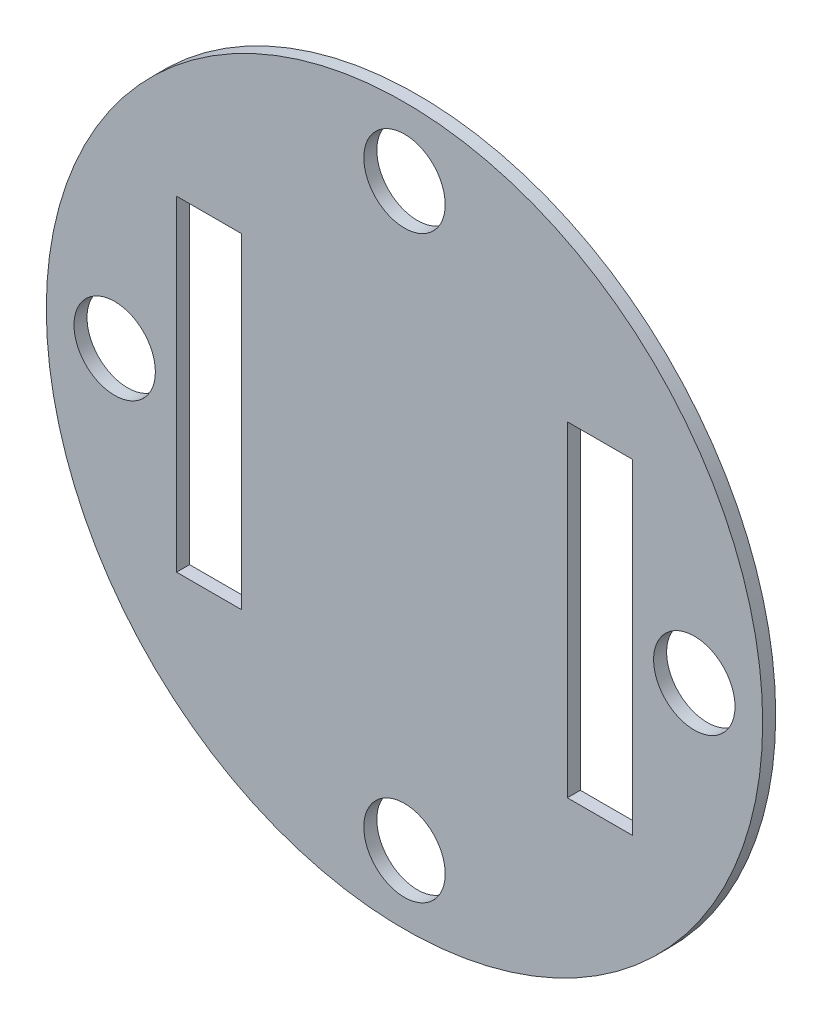
ISO-10303-21;
HEADER;
FILE_DESCRIPTION(('STEP AP214'),'2;1');
FILE_NAME('part.step','',(''),(''),'','','');
FILE_SCHEMA(('AUTOMOTIVE_DESIGN { 1 0 10303 214 1 1 1 1 }'));
ENDSEC;
DATA;
#1=APPLICATION_CONTEXT('core data for automotive mechanical design processes');
#2=APPLICATION_PROTOCOL_DEFINITION('international standard','automotive_design',2000,#1);
#3=PRODUCT_CONTEXT('',#1,'mechanical');
#4=PRODUCT('Part','Part','',(#3));
#5=PRODUCT_RELATED_PRODUCT_CATEGORY('part','',(#4));
#6=PRODUCT_DEFINITION_FORMATION('','',#4);
#7=PRODUCT_DEFINITION_CONTEXT('part definition',#1,'design');
#8=PRODUCT_DEFINITION('design','',#6,#7);
#9=PRODUCT_DEFINITION_SHAPE('','',#8);
#10=(LENGTH_UNIT() NAMED_UNIT(*) SI_UNIT(.MILLI.,.METRE.));
#11=(NAMED_UNIT(*) PLANE_ANGLE_UNIT() SI_UNIT($,.RADIAN.));
#12=(NAMED_UNIT(*) SI_UNIT($,.STERADIAN.) SOLID_ANGLE_UNIT());
#13=UNCERTAINTY_MEASURE_WITH_UNIT(LENGTH_MEASURE(1.E-05),#10,'distance_accuracy_value','');
#14=(GEOMETRIC_REPRESENTATION_CONTEXT(3) GLOBAL_UNCERTAINTY_ASSIGNED_CONTEXT((#13)) GLOBAL_UNIT_ASSIGNED_CONTEXT((#10,
#11,#12)) REPRESENTATION_CONTEXT('',''));
#15=CARTESIAN_POINT('',(0.,0.,0.));
#16=DIRECTION('',(0.,0.,1.));
#17=DIRECTION('',(1.,0.,0.));
#18=AXIS2_PLACEMENT_3D('',#15,#16,#17);
#19=CARTESIAN_POINT('',(0.,0.,0.));
#20=DIRECTION('',(0.,0.,1.));
#21=DIRECTION('',(1.,0.,0.));
#22=AXIS2_PLACEMENT_3D('',#19,#20,#21);
#23=PLANE('',#22);
#24=DIRECTION('',(-1.,0.,0.));
#25=VECTOR('',#24,1.);
#26=CARTESIAN_POINT('',(0.,25.,0.));
#27=LINE('',#26,#25);
#28=CARTESIAN_POINT('',(35.,25.,0.));
#29=VERTEX_POINT('',#28);
#30=CARTESIAN_POINT('',(25.,25.,0.));
#31=VERTEX_POINT('',#30);
#32=EDGE_CURVE('E241',#29,#31,#27,.T.);
#33=ORIENTED_EDGE('',*,*,#32,.T.);
#34=DIRECTION('',(0.,-1.,0.));
#35=VECTOR('',#34,1.);
#36=CARTESIAN_POINT('',(25.,0.,0.));
#37=LINE('',#36,#35);
#38=CARTESIAN_POINT('',(25.,-25.,0.));
#39=VERTEX_POINT('',#38);
#40=EDGE_CURVE('E245',#31,#39,#37,.T.);
#41=ORIENTED_EDGE('',*,*,#40,.T.);
#42=DIRECTION('',(1.,0.,0.));
#43=VECTOR('',#42,1.);
#44=CARTESIAN_POINT('',(0.,-25.,0.));
#45=LINE('',#44,#43);
#46=CARTESIAN_POINT('',(35.,-25.,0.));
#47=VERTEX_POINT('',#46);
#48=EDGE_CURVE('E236',#39,#47,#45,.T.);
#49=ORIENTED_EDGE('',*,*,#48,.T.);
#50=DIRECTION('',(0.,1.,0.));
#51=VECTOR('',#50,1.);
#52=CARTESIAN_POINT('',(35.,0.,0.));
#53=LINE('',#52,#51);
#54=EDGE_CURVE('E171',#47,#29,#53,.T.);
#55=ORIENTED_EDGE('',*,*,#54,.T.);
#56=EDGE_LOOP('',(#33,#41,#49,#55));
#57=FACE_BOUND('',#56,.T.);
#58=DIRECTION('',(-1.,0.,0.));
#59=VECTOR('',#58,1.);
#60=CARTESIAN_POINT('',(0.,25.,0.));
#61=LINE('',#60,#59);
#62=CARTESIAN_POINT('',(-25.,25.,0.));
#63=VERTEX_POINT('',#62);
#64=CARTESIAN_POINT('',(-35.,25.,0.));
#65=VERTEX_POINT('',#64);
#66=EDGE_CURVE('E228',#63,#65,#61,.T.);
#67=ORIENTED_EDGE('',*,*,#66,.T.);
#68=DIRECTION('',(0.,-1.,0.));
#69=VECTOR('',#68,1.);
#70=CARTESIAN_POINT('',(-35.,0.,0.));
#71=LINE('',#70,#69);
#72=CARTESIAN_POINT('',(-35.,-25.,0.));
#73=VERTEX_POINT('',#72);
#74=EDGE_CURVE('E232',#65,#73,#71,.T.);
#75=ORIENTED_EDGE('',*,*,#74,.T.);
#76=DIRECTION('',(1.,0.,0.));
#77=VECTOR('',#76,1.);
#78=CARTESIAN_POINT('',(0.,-25.,0.));
#79=LINE('',#78,#77);
#80=CARTESIAN_POINT('',(-25.,-25.,0.));
#81=VERTEX_POINT('',#80);
#82=EDGE_CURVE('E190',#73,#81,#79,.T.);
#83=ORIENTED_EDGE('',*,*,#82,.T.);
#84=DIRECTION('',(0.,1.,0.));
#85=VECTOR('',#84,1.);
#86=CARTESIAN_POINT('',(-25.,0.,0.));
#87=LINE('',#86,#85);
#88=EDGE_CURVE('E224',#81,#63,#87,.T.);
#89=ORIENTED_EDGE('',*,*,#88,.T.);
#90=EDGE_LOOP('',(#67,#75,#83,#89));
#91=FACE_BOUND('',#90,.T.);
#92=CARTESIAN_POINT('',(44.5,0.,0.));
#93=DIRECTION('',(0.,0.,1.));
#94=DIRECTION('',(1.,0.,0.));
#95=AXIS2_PLACEMENT_3D('',#92,#93,#94);
#96=CIRCLE('',#95,6.25);
#97=CARTESIAN_POINT('',(50.75,0.,0.));
#98=VERTEX_POINT('',#97);
#99=EDGE_CURVE('E250',#98,#98,#96,.T.);
#100=ORIENTED_EDGE('',*,*,#99,.T.);
#101=EDGE_LOOP('',(#100));
#102=FACE_BOUND('',#101,.T.);
#103=CARTESIAN_POINT('',(0.,44.5,0.));
#104=DIRECTION('',(0.,0.,1.));
#105=DIRECTION('',(1.,0.,0.));
#106=AXIS2_PLACEMENT_3D('',#103,#104,#105);
#107=CIRCLE('',#106,6.25);
#108=CARTESIAN_POINT('',(6.25,44.5,0.));
#109=VERTEX_POINT('',#108);
#110=EDGE_CURVE('E262',#109,#109,#107,.T.);
#111=ORIENTED_EDGE('',*,*,#110,.T.);
#112=EDGE_LOOP('',(#111));
#113=FACE_BOUND('',#112,.T.);
#114=CARTESIAN_POINT('',(-44.5,0.,0.));
#115=DIRECTION('',(0.,0.,1.));
#116=DIRECTION('',(1.,0.,0.));
#117=AXIS2_PLACEMENT_3D('',#114,#115,#116);
#118=CIRCLE('',#117,6.25);
#119=CARTESIAN_POINT('',(-38.25,0.,0.));
#120=VERTEX_POINT('',#119);
#121=EDGE_CURVE('E270',#120,#120,#118,.T.);
#122=ORIENTED_EDGE('',*,*,#121,.T.);
#123=EDGE_LOOP('',(#122));
#124=FACE_BOUND('',#123,.T.);
#125=CARTESIAN_POINT('',(0.,-44.5,0.));
#126=DIRECTION('',(0.,0.,1.));
#127=DIRECTION('',(1.,0.,0.));
#128=AXIS2_PLACEMENT_3D('',#125,#126,#127);
#129=CIRCLE('',#128,6.25);
#130=CARTESIAN_POINT('',(6.25,-44.5,0.));
#131=VERTEX_POINT('',#130);
#132=EDGE_CURVE('E249',#131,#131,#129,.T.);
#133=ORIENTED_EDGE('',*,*,#132,.T.);
#134=EDGE_LOOP('',(#133));
#135=FACE_BOUND('',#134,.T.);
#136=CARTESIAN_POINT('',(0.,0.,0.));
#137=DIRECTION('',(0.,0.,1.));
#138=DIRECTION('',(1.,0.,0.));
#139=AXIS2_PLACEMENT_3D('',#136,#137,#138);
#140=CIRCLE('',#139,55.);
#141=CARTESIAN_POINT('',(55.,0.,0.));
#142=VERTEX_POINT('',#141);
#143=EDGE_CURVE('E12',#142,#142,#140,.F.);
#144=ORIENTED_EDGE('',*,*,#143,.T.);
#145=EDGE_LOOP('',(#144));
#146=FACE_BOUND('',#145,.T.);
#147=ADVANCED_FACE('F91',(#57,#91,#102,#113,#124,#135,#146),#23,.F.);
#148=CARTESIAN_POINT('',(0.,0.,2.));
#149=DIRECTION('',(0.,0.,1.));
#150=DIRECTION('',(1.,0.,0.));
#151=AXIS2_PLACEMENT_3D('',#148,#149,#150);
#152=PLANE('',#151);
#153=DIRECTION('',(-1.,0.,0.));
#154=VECTOR('',#153,1.);
#155=CARTESIAN_POINT('',(25.,25.,2.));
#156=LINE('',#155,#154);
#157=CARTESIAN_POINT('',(35.,25.,2.));
#158=VERTEX_POINT('',#157);
#159=CARTESIAN_POINT('',(25.,25.,2.));
#160=VERTEX_POINT('',#159);
#161=EDGE_CURVE('E179',#158,#160,#156,.T.);
#162=ORIENTED_EDGE('',*,*,#161,.F.);
#163=DIRECTION('',(0.,1.,0.));
#164=VECTOR('',#163,1.);
#165=CARTESIAN_POINT('',(35.,25.,2.));
#166=LINE('',#165,#164);
#167=CARTESIAN_POINT('',(35.,-25.,2.));
#168=VERTEX_POINT('',#167);
#169=EDGE_CURVE('E163',#168,#158,#166,.T.);
#170=ORIENTED_EDGE('',*,*,#169,.F.);
#171=DIRECTION('',(1.,0.,0.));
#172=VECTOR('',#171,1.);
#173=CARTESIAN_POINT('',(25.,-25.,2.));
#174=LINE('',#173,#172);
#175=CARTESIAN_POINT('',(25.,-25.,2.));
#176=VERTEX_POINT('',#175);
#177=EDGE_CURVE('E155',#176,#168,#174,.T.);
#178=ORIENTED_EDGE('',*,*,#177,.F.);
#179=DIRECTION('',(0.,-1.,0.));
#180=VECTOR('',#179,1.);
#181=CARTESIAN_POINT('',(25.,25.,2.));
#182=LINE('',#181,#180);
#183=EDGE_CURVE('E164',#160,#176,#182,.T.);
#184=ORIENTED_EDGE('',*,*,#183,.F.);
#185=EDGE_LOOP('',(#162,#170,#178,#184));
#186=FACE_BOUND('',#185,.T.);
#187=CARTESIAN_POINT('',(0.,-44.5,2.));
#188=DIRECTION('',(0.,0.,1.));
#189=DIRECTION('',(1.,0.,0.));
#190=AXIS2_PLACEMENT_3D('',#187,#188,#189);
#191=CIRCLE('',#190,6.25);
#192=CARTESIAN_POINT('',(6.25,-44.5,2.));
#193=VERTEX_POINT('',#192);
#194=EDGE_CURVE('E274',#193,#193,#191,.T.);
#195=ORIENTED_EDGE('',*,*,#194,.F.);
#196=EDGE_LOOP('',(#195));
#197=FACE_BOUND('',#196,.T.);
#198=DIRECTION('',(0.,1.,0.));
#199=VECTOR('',#198,1.);
#200=CARTESIAN_POINT('',(-25.,25.,2.));
#201=LINE('',#200,#199);
#202=CARTESIAN_POINT('',(-25.,-25.,2.));
#203=VERTEX_POINT('',#202);
#204=CARTESIAN_POINT('',(-25.,25.,2.));
#205=VERTEX_POINT('',#204);
#206=EDGE_CURVE('E201',#203,#205,#201,.T.);
#207=ORIENTED_EDGE('',*,*,#206,.F.);
#208=DIRECTION('',(1.,0.,0.));
#209=VECTOR('',#208,1.);
#210=CARTESIAN_POINT('',(-35.,-25.,2.));
#211=LINE('',#210,#209);
#212=CARTESIAN_POINT('',(-35.,-25.,2.));
#213=VERTEX_POINT('',#212);
#214=EDGE_CURVE('E198',#213,#203,#211,.T.);
#215=ORIENTED_EDGE('',*,*,#214,.F.);
#216=DIRECTION('',(0.,-1.,0.));
#217=VECTOR('',#216,1.);
#218=CARTESIAN_POINT('',(-35.,25.,2.));
#219=LINE('',#218,#217);
#220=CARTESIAN_POINT('',(-35.,25.,2.));
#221=VERTEX_POINT('',#220);
#222=EDGE_CURVE('E195',#221,#213,#219,.T.);
#223=ORIENTED_EDGE('',*,*,#222,.F.);
#224=DIRECTION('',(-1.,0.,0.));
#225=VECTOR('',#224,1.);
#226=CARTESIAN_POINT('',(-35.,25.,2.));
#227=LINE('',#226,#225);
#228=EDGE_CURVE('E205',#205,#221,#227,.T.);
#229=ORIENTED_EDGE('',*,*,#228,.F.);
#230=EDGE_LOOP('',(#207,#215,#223,#229));
#231=FACE_BOUND('',#230,.T.);
#232=CARTESIAN_POINT('',(-44.5,0.,2.));
#233=DIRECTION('',(0.,0.,1.));
#234=DIRECTION('',(1.,0.,0.));
#235=AXIS2_PLACEMENT_3D('',#232,#233,#234);
#236=CIRCLE('',#235,6.25);
#237=CARTESIAN_POINT('',(-38.25,0.,2.));
#238=VERTEX_POINT('',#237);
#239=EDGE_CURVE('E266',#238,#238,#236,.T.);
#240=ORIENTED_EDGE('',*,*,#239,.F.);
#241=EDGE_LOOP('',(#240));
#242=FACE_BOUND('',#241,.T.);
#243=CARTESIAN_POINT('',(0.,44.5,2.));
#244=DIRECTION('',(0.,0.,1.));
#245=DIRECTION('',(1.,0.,0.));
#246=AXIS2_PLACEMENT_3D('',#243,#244,#245);
#247=CIRCLE('',#246,6.25);
#248=CARTESIAN_POINT('',(6.25,44.5,2.));
#249=VERTEX_POINT('',#248);
#250=EDGE_CURVE('E258',#249,#249,#247,.T.);
#251=ORIENTED_EDGE('',*,*,#250,.F.);
#252=EDGE_LOOP('',(#251));
#253=FACE_BOUND('',#252,.T.);
#254=CARTESIAN_POINT('',(44.5,0.,2.));
#255=DIRECTION('',(0.,0.,1.));
#256=DIRECTION('',(1.,0.,0.));
#257=AXIS2_PLACEMENT_3D('',#254,#255,#256);
#258=CIRCLE('',#257,6.25);
#259=CARTESIAN_POINT('',(50.75,0.,2.));
#260=VERTEX_POINT('',#259);
#261=EDGE_CURVE('E254',#260,#260,#258,.T.);
#262=ORIENTED_EDGE('',*,*,#261,.F.);
#263=EDGE_LOOP('',(#262));
#264=FACE_BOUND('',#263,.T.);
#265=CARTESIAN_POINT('',(0.,0.,2.));
#266=DIRECTION('',(0.,0.,-1.));
#267=DIRECTION('',(1.,0.,0.));
#268=AXIS2_PLACEMENT_3D('',#265,#266,#267);
#269=CIRCLE('',#268,55.);
#270=CARTESIAN_POINT('',(55.,0.,2.));
#271=VERTEX_POINT('',#270);
#272=EDGE_CURVE('E99',#271,#271,#269,.T.);
#273=ORIENTED_EDGE('',*,*,#272,.F.);
#274=EDGE_LOOP('',(#273));
#275=FACE_BOUND('',#274,.T.);
#276=ADVANCED_FACE('F177',(#186,#197,#231,#242,#253,#264,#275),#152,.T.);
#277=CARTESIAN_POINT('',(0.,0.,-49.9999999999996));
#278=DIRECTION('',(0.,0.,1.));
#279=DIRECTION('',(1.,0.,0.));
#280=AXIS2_PLACEMENT_3D('',#277,#278,#279);
#281=CYLINDRICAL_SURFACE('',#280,55.);
#282=ORIENTED_EDGE('',*,*,#272,.T.);
#283=EDGE_LOOP('',(#282));
#284=FACE_BOUND('',#283,.T.);
#285=ORIENTED_EDGE('',*,*,#143,.F.);
#286=EDGE_LOOP('',(#285));
#287=FACE_BOUND('',#286,.T.);
#288=ADVANCED_FACE('F284',(#284,#287),#281,.T.);
#289=CARTESIAN_POINT('',(0.,-44.5,0.));
#290=DIRECTION('',(0.,0.,1.));
#291=DIRECTION('',(1.,0.,0.));
#292=AXIS2_PLACEMENT_3D('',#289,#290,#291);
#293=CYLINDRICAL_SURFACE('',#292,6.25);
#294=ORIENTED_EDGE('',*,*,#132,.F.);
#295=EDGE_LOOP('',(#294));
#296=FACE_BOUND('',#295,.T.);
#297=ORIENTED_EDGE('',*,*,#194,.T.);
#298=EDGE_LOOP('',(#297));
#299=FACE_BOUND('',#298,.T.);
#300=ADVANCED_FACE('F292',(#296,#299),#293,.F.);
#301=CARTESIAN_POINT('',(-44.5,0.,0.));
#302=DIRECTION('',(0.,0.,1.));
#303=DIRECTION('',(1.,0.,0.));
#304=AXIS2_PLACEMENT_3D('',#301,#302,#303);
#305=CYLINDRICAL_SURFACE('',#304,6.25);
#306=ORIENTED_EDGE('',*,*,#121,.F.);
#307=EDGE_LOOP('',(#306));
#308=FACE_BOUND('',#307,.T.);
#309=ORIENTED_EDGE('',*,*,#239,.T.);
#310=EDGE_LOOP('',(#309));
#311=FACE_BOUND('',#310,.T.);
#312=ADVANCED_FACE('F298',(#308,#311),#305,.F.);
#313=CARTESIAN_POINT('',(0.,44.5,0.));
#314=DIRECTION('',(0.,0.,1.));
#315=DIRECTION('',(1.,0.,0.));
#316=AXIS2_PLACEMENT_3D('',#313,#314,#315);
#317=CYLINDRICAL_SURFACE('',#316,6.25);
#318=ORIENTED_EDGE('',*,*,#110,.F.);
#319=EDGE_LOOP('',(#318));
#320=FACE_BOUND('',#319,.T.);
#321=ORIENTED_EDGE('',*,*,#250,.T.);
#322=EDGE_LOOP('',(#321));
#323=FACE_BOUND('',#322,.T.);
#324=ADVANCED_FACE('F302',(#320,#323),#317,.F.);
#325=CARTESIAN_POINT('',(44.5,0.,0.));
#326=DIRECTION('',(0.,0.,1.));
#327=DIRECTION('',(1.,0.,0.));
#328=AXIS2_PLACEMENT_3D('',#325,#326,#327);
#329=CYLINDRICAL_SURFACE('',#328,6.25);
#330=ORIENTED_EDGE('',*,*,#99,.F.);
#331=EDGE_LOOP('',(#330));
#332=FACE_BOUND('',#331,.T.);
#333=ORIENTED_EDGE('',*,*,#261,.T.);
#334=EDGE_LOOP('',(#333));
#335=FACE_BOUND('',#334,.T.);
#336=ADVANCED_FACE('F306',(#332,#335),#329,.F.);
#337=CARTESIAN_POINT('',(-35.,25.,-1.));
#338=DIRECTION('',(-1.,0.,0.));
#339=DIRECTION('',(0.,-1.,0.));
#340=AXIS2_PLACEMENT_3D('',#337,#338,#339);
#341=PLANE('',#340);
#342=DIRECTION('',(0.,0.,1.));
#343=VECTOR('',#342,1.);
#344=CARTESIAN_POINT('',(-35.,25.,-1.));
#345=LINE('',#344,#343);
#346=EDGE_CURVE('E209',#65,#221,#345,.T.);
#347=ORIENTED_EDGE('',*,*,#346,.T.);
#348=ORIENTED_EDGE('',*,*,#222,.T.);
#349=DIRECTION('',(0.,0.,1.));
#350=VECTOR('',#349,1.);
#351=CARTESIAN_POINT('',(-35.,-25.,-1.));
#352=LINE('',#351,#350);
#353=EDGE_CURVE('E208',#73,#213,#352,.T.);
#354=ORIENTED_EDGE('',*,*,#353,.F.);
#355=ORIENTED_EDGE('',*,*,#74,.F.);
#356=EDGE_LOOP('',(#347,#348,#354,#355));
#357=FACE_BOUND('',#356,.T.);
#358=ADVANCED_FACE('F310',(#357),#341,.F.);
#359=CARTESIAN_POINT('',(-35.,25.,-1.));
#360=DIRECTION('',(0.,1.,0.));
#361=DIRECTION('',(-1.,0.,0.));
#362=AXIS2_PLACEMENT_3D('',#359,#360,#361);
#363=PLANE('',#362);
#364=DIRECTION('',(0.,0.,1.));
#365=VECTOR('',#364,1.);
#366=CARTESIAN_POINT('',(-25.,25.,-1.));
#367=LINE('',#366,#365);
#368=EDGE_CURVE('E213',#63,#205,#367,.T.);
#369=ORIENTED_EDGE('',*,*,#368,.T.);
#370=ORIENTED_EDGE('',*,*,#228,.T.);
#371=ORIENTED_EDGE('',*,*,#346,.F.);
#372=ORIENTED_EDGE('',*,*,#66,.F.);
#373=EDGE_LOOP('',(#369,#370,#371,#372));
#374=FACE_BOUND('',#373,.T.);
#375=ADVANCED_FACE('F314',(#374),#363,.F.);
#376=CARTESIAN_POINT('',(-25.,25.,-1.));
#377=DIRECTION('',(1.,0.,0.));
#378=DIRECTION('',(0.,1.,0.));
#379=AXIS2_PLACEMENT_3D('',#376,#377,#378);
#380=PLANE('',#379);
#381=DIRECTION('',(0.,0.,1.));
#382=VECTOR('',#381,1.);
#383=CARTESIAN_POINT('',(-25.,-25.,-1.));
#384=LINE('',#383,#382);
#385=EDGE_CURVE('E114',#81,#203,#384,.T.);
#386=ORIENTED_EDGE('',*,*,#385,.T.);
#387=ORIENTED_EDGE('',*,*,#206,.T.);
#388=ORIENTED_EDGE('',*,*,#368,.F.);
#389=ORIENTED_EDGE('',*,*,#88,.F.);
#390=EDGE_LOOP('',(#386,#387,#388,#389));
#391=FACE_BOUND('',#390,.T.);
#392=ADVANCED_FACE('F320',(#391),#380,.F.);
#393=CARTESIAN_POINT('',(-35.,-25.,-1.));
#394=DIRECTION('',(0.,-1.,0.));
#395=DIRECTION('',(0.,0.,-1.));
#396=AXIS2_PLACEMENT_3D('',#393,#394,#395);
#397=PLANE('',#396);
#398=ORIENTED_EDGE('',*,*,#353,.T.);
#399=ORIENTED_EDGE('',*,*,#214,.T.);
#400=ORIENTED_EDGE('',*,*,#385,.F.);
#401=ORIENTED_EDGE('',*,*,#82,.F.);
#402=EDGE_LOOP('',(#398,#399,#400,#401));
#403=FACE_BOUND('',#402,.T.);
#404=ADVANCED_FACE('F316',(#403),#397,.F.);
#405=CARTESIAN_POINT('',(25.,25.,-1.));
#406=DIRECTION('',(-1.,0.,0.));
#407=DIRECTION('',(0.,-1.,0.));
#408=AXIS2_PLACEMENT_3D('',#405,#406,#407);
#409=PLANE('',#408);
#410=DIRECTION('',(0.,0.,1.));
#411=VECTOR('',#410,1.);
#412=CARTESIAN_POINT('',(25.,25.,-1.));
#413=LINE('',#412,#411);
#414=EDGE_CURVE('E186',#31,#160,#413,.T.);
#415=ORIENTED_EDGE('',*,*,#414,.T.);
#416=ORIENTED_EDGE('',*,*,#183,.T.);
#417=DIRECTION('',(0.,0.,1.));
#418=VECTOR('',#417,1.);
#419=CARTESIAN_POINT('',(25.,-25.,-1.));
#420=LINE('',#419,#418);
#421=EDGE_CURVE('E158',#39,#176,#420,.T.);
#422=ORIENTED_EDGE('',*,*,#421,.F.);
#423=ORIENTED_EDGE('',*,*,#40,.F.);
#424=EDGE_LOOP('',(#415,#416,#422,#423));
#425=FACE_BOUND('',#424,.T.);
#426=ADVANCED_FACE('F319',(#425),#409,.F.);
#427=CARTESIAN_POINT('',(25.,25.,-1.));
#428=DIRECTION('',(0.,1.,0.));
#429=DIRECTION('',(-1.,0.,0.));
#430=AXIS2_PLACEMENT_3D('',#427,#428,#429);
#431=PLANE('',#430);
#432=DIRECTION('',(0.,0.,1.));
#433=VECTOR('',#432,1.);
#434=CARTESIAN_POINT('',(35.,25.,-1.));
#435=LINE('',#434,#433);
#436=EDGE_CURVE('E174',#29,#158,#435,.T.);
#437=ORIENTED_EDGE('',*,*,#436,.T.);
#438=ORIENTED_EDGE('',*,*,#161,.T.);
#439=ORIENTED_EDGE('',*,*,#414,.F.);
#440=ORIENTED_EDGE('',*,*,#32,.F.);
#441=EDGE_LOOP('',(#437,#438,#439,#440));
#442=FACE_BOUND('',#441,.T.);
#443=ADVANCED_FACE('F329',(#442),#431,.F.);
#444=CARTESIAN_POINT('',(35.,25.,-1.));
#445=DIRECTION('',(1.,0.,0.));
#446=DIRECTION('',(0.,1.,0.));
#447=AXIS2_PLACEMENT_3D('',#444,#445,#446);
#448=PLANE('',#447);
#449=DIRECTION('',(0.,0.,1.));
#450=VECTOR('',#449,1.);
#451=CARTESIAN_POINT('',(35.,-25.,-1.));
#452=LINE('',#451,#450);
#453=EDGE_CURVE('E106',#47,#168,#452,.T.);
#454=ORIENTED_EDGE('',*,*,#453,.T.);
#455=ORIENTED_EDGE('',*,*,#169,.T.);
#456=ORIENTED_EDGE('',*,*,#436,.F.);
#457=ORIENTED_EDGE('',*,*,#54,.F.);
#458=EDGE_LOOP('',(#454,#455,#456,#457));
#459=FACE_BOUND('',#458,.T.);
#460=ADVANCED_FACE('F167',(#459),#448,.F.);
#461=CARTESIAN_POINT('',(25.,-25.,-1.));
#462=DIRECTION('',(0.,-1.,0.));
#463=DIRECTION('',(0.,0.,-1.));
#464=AXIS2_PLACEMENT_3D('',#461,#462,#463);
#465=PLANE('',#464);
#466=ORIENTED_EDGE('',*,*,#421,.T.);
#467=ORIENTED_EDGE('',*,*,#177,.T.);
#468=ORIENTED_EDGE('',*,*,#453,.F.);
#469=ORIENTED_EDGE('',*,*,#48,.F.);
#470=EDGE_LOOP('',(#466,#467,#468,#469));
#471=FACE_BOUND('',#470,.T.);
#472=ADVANCED_FACE('F156',(#471),#465,.F.);
#473=CLOSED_SHELL('',(#147,#276,#288,#300,#312,#324,#336,#358,#375,#392,#404,#426,#443,#460,#472));
#474=MANIFOLD_SOLID_BREP('B2',#473);
#475=ADVANCED_BREP_SHAPE_REPRESENTATION('',(#18,#474),#14);
#476=SHAPE_DEFINITION_REPRESENTATION(#9,#475);
ENDSEC;
END-ISO-10303-21;
